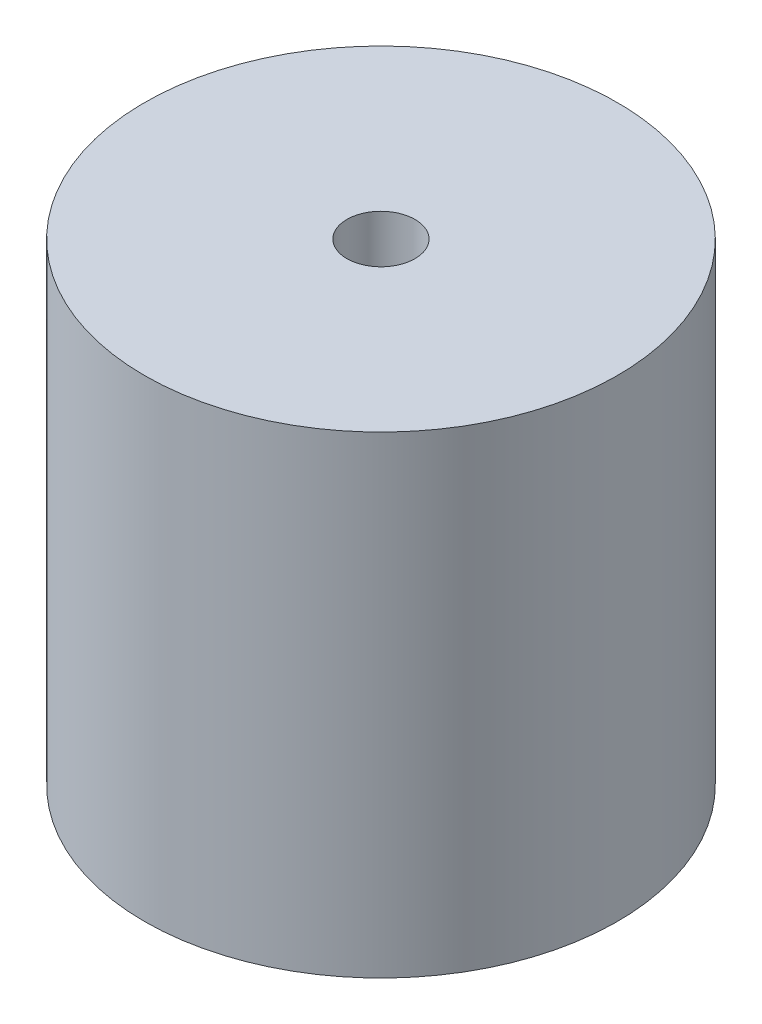
ISO-10303-21;
HEADER;
FILE_DESCRIPTION(('STEP AP214'),'2;1');
FILE_NAME('part.step','',(''),(''),'','','');
FILE_SCHEMA(('AUTOMOTIVE_DESIGN { 1 0 10303 214 1 1 1 1 }'));
ENDSEC;
DATA;
#1=APPLICATION_CONTEXT('core data for automotive mechanical design processes');
#2=APPLICATION_PROTOCOL_DEFINITION('international standard','automotive_design',2000,#1);
#3=PRODUCT_CONTEXT('',#1,'mechanical');
#4=PRODUCT('Part','Part','',(#3));
#5=PRODUCT_RELATED_PRODUCT_CATEGORY('part','',(#4));
#6=PRODUCT_DEFINITION_FORMATION('','',#4);
#7=PRODUCT_DEFINITION_CONTEXT('part definition',#1,'design');
#8=PRODUCT_DEFINITION('design','',#6,#7);
#9=PRODUCT_DEFINITION_SHAPE('','',#8);
#10=(LENGTH_UNIT() NAMED_UNIT(*) SI_UNIT(.MILLI.,.METRE.));
#11=(NAMED_UNIT(*) PLANE_ANGLE_UNIT() SI_UNIT($,.RADIAN.));
#12=(NAMED_UNIT(*) SI_UNIT($,.STERADIAN.) SOLID_ANGLE_UNIT());
#13=UNCERTAINTY_MEASURE_WITH_UNIT(LENGTH_MEASURE(1.E-05),#10,'distance_accuracy_value','');
#14=(GEOMETRIC_REPRESENTATION_CONTEXT(3) GLOBAL_UNCERTAINTY_ASSIGNED_CONTEXT((#13)) GLOBAL_UNIT_ASSIGNED_CONTEXT((#10,
#11,#12)) REPRESENTATION_CONTEXT('',''));
#15=CARTESIAN_POINT('',(0.,0.,0.));
#16=DIRECTION('',(0.,0.,1.));
#17=DIRECTION('',(1.,0.,0.));
#18=AXIS2_PLACEMENT_3D('',#15,#16,#17);
#19=CARTESIAN_POINT('',(0.,25.4,0.));
#20=DIRECTION('',(0.,1.,0.));
#21=DIRECTION('',(0.,0.,1.));
#22=AXIS2_PLACEMENT_3D('',#19,#20,#21);
#23=PLANE('',#22);
#24=CARTESIAN_POINT('',(0.,25.4,0.));
#25=DIRECTION('',(0.,1.,0.));
#26=DIRECTION('',(0.,0.,1.));
#27=AXIS2_PLACEMENT_3D('',#24,#25,#26);
#28=CIRCLE('',#27,12.7);
#29=CARTESIAN_POINT('',(0.,25.4,12.7));
#30=VERTEX_POINT('',#29);
#31=EDGE_CURVE('E10',#30,#30,#28,.T.);
#32=ORIENTED_EDGE('',*,*,#31,.T.);
#33=EDGE_LOOP('',(#32));
#34=FACE_BOUND('',#33,.T.);
#35=CARTESIAN_POINT('',(0.,25.4,0.));
#36=DIRECTION('',(0.,1.,0.));
#37=DIRECTION('',(0.,0.,1.));
#38=AXIS2_PLACEMENT_3D('',#35,#36,#37);
#39=CIRCLE('',#38,1.8288);
#40=CARTESIAN_POINT('',(0.,25.4,1.8288));
#41=VERTEX_POINT('',#40);
#42=EDGE_CURVE('E50',#41,#41,#39,.T.);
#43=ORIENTED_EDGE('',*,*,#42,.F.);
#44=EDGE_LOOP('',(#43));
#45=FACE_BOUND('',#44,.T.);
#46=ADVANCED_FACE('F37',(#34,#45),#23,.T.);
#47=CARTESIAN_POINT('',(0.,0.,0.));
#48=DIRECTION('',(0.,1.,0.));
#49=DIRECTION('',(0.,0.,1.));
#50=AXIS2_PLACEMENT_3D('',#47,#48,#49);
#51=PLANE('',#50);
#52=CARTESIAN_POINT('',(0.,0.,0.));
#53=DIRECTION('',(0.,1.,0.));
#54=DIRECTION('',(0.,0.,1.));
#55=AXIS2_PLACEMENT_3D('',#52,#53,#54);
#56=CIRCLE('',#55,12.7);
#57=CARTESIAN_POINT('',(0.,0.,12.7));
#58=VERTEX_POINT('',#57);
#59=EDGE_CURVE('E41',#58,#58,#56,.T.);
#60=ORIENTED_EDGE('',*,*,#59,.F.);
#61=EDGE_LOOP('',(#60));
#62=FACE_BOUND('',#61,.T.);
#63=CARTESIAN_POINT('',(0.,0.,0.));
#64=DIRECTION('',(0.,1.,0.));
#65=DIRECTION('',(0.,0.,1.));
#66=AXIS2_PLACEMENT_3D('',#63,#64,#65);
#67=CIRCLE('',#66,1.8288);
#68=CARTESIAN_POINT('',(0.,0.,1.8288));
#69=VERTEX_POINT('',#68);
#70=EDGE_CURVE('E52',#69,#69,#67,.T.);
#71=ORIENTED_EDGE('',*,*,#70,.T.);
#72=EDGE_LOOP('',(#71));
#73=FACE_BOUND('',#72,.T.);
#74=ADVANCED_FACE('F64',(#62,#73),#51,.F.);
#75=CARTESIAN_POINT('',(0.,25.4,0.));
#76=DIRECTION('',(0.,-1.,0.));
#77=DIRECTION('',(0.,0.,-1.));
#78=AXIS2_PLACEMENT_3D('',#75,#76,#77);
#79=CYLINDRICAL_SURFACE('',#78,12.7);
#80=ORIENTED_EDGE('',*,*,#31,.F.);
#81=EDGE_LOOP('',(#80));
#82=FACE_BOUND('',#81,.T.);
#83=ORIENTED_EDGE('',*,*,#59,.T.);
#84=EDGE_LOOP('',(#83));
#85=FACE_BOUND('',#84,.T.);
#86=ADVANCED_FACE('F39',(#82,#85),#79,.T.);
#87=CARTESIAN_POINT('',(0.,25.4,0.));
#88=DIRECTION('',(0.,-1.,0.));
#89=DIRECTION('',(0.,0.,-1.));
#90=AXIS2_PLACEMENT_3D('',#87,#88,#89);
#91=CYLINDRICAL_SURFACE('',#90,1.8288);
#92=ORIENTED_EDGE('',*,*,#42,.T.);
#93=EDGE_LOOP('',(#92));
#94=FACE_BOUND('',#93,.T.);
#95=ORIENTED_EDGE('',*,*,#70,.F.);
#96=EDGE_LOOP('',(#95));
#97=FACE_BOUND('',#96,.T.);
#98=ADVANCED_FACE('F60',(#94,#97),#91,.F.);
#99=CLOSED_SHELL('',(#46,#74,#86,#98));
#100=MANIFOLD_SOLID_BREP('B2',#99);
#101=ADVANCED_BREP_SHAPE_REPRESENTATION('',(#18,#100),#14);
#102=SHAPE_DEFINITION_REPRESENTATION(#9,#101);
ENDSEC;
END-ISO-10303-21;
